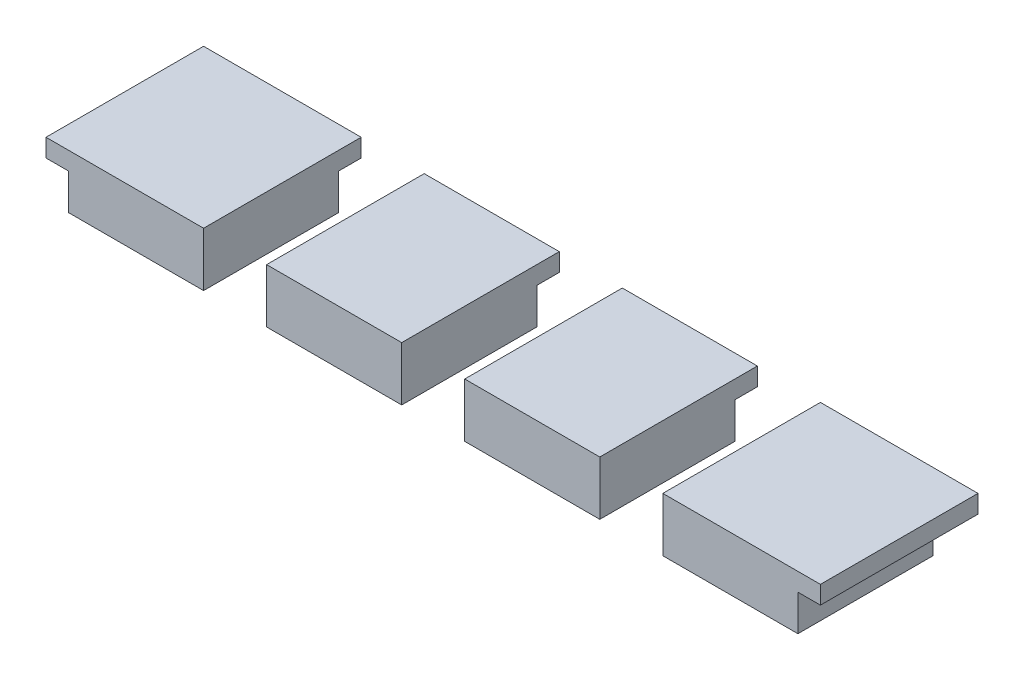
ISO-10303-21;
HEADER;
FILE_DESCRIPTION(('STEP AP214'),'2;1');
FILE_NAME('part.step','',(''),(''),'','','');
FILE_SCHEMA(('AUTOMOTIVE_DESIGN { 1 0 10303 214 1 1 1 1 }'));
ENDSEC;
DATA;
#1=APPLICATION_CONTEXT('core data for automotive mechanical design processes');
#2=APPLICATION_PROTOCOL_DEFINITION('international standard','automotive_design',2000,#1);
#3=PRODUCT_CONTEXT('',#1,'mechanical');
#4=PRODUCT('Part','Part','',(#3));
#5=PRODUCT_RELATED_PRODUCT_CATEGORY('part','',(#4));
#6=PRODUCT_DEFINITION_FORMATION('','',#4);
#7=PRODUCT_DEFINITION_CONTEXT('part definition',#1,'design');
#8=PRODUCT_DEFINITION('design','',#6,#7);
#9=PRODUCT_DEFINITION_SHAPE('','',#8);
#10=(LENGTH_UNIT() NAMED_UNIT(*) SI_UNIT(.MILLI.,.METRE.));
#11=(NAMED_UNIT(*) PLANE_ANGLE_UNIT() SI_UNIT($,.RADIAN.));
#12=(NAMED_UNIT(*) SI_UNIT($,.STERADIAN.) SOLID_ANGLE_UNIT());
#13=UNCERTAINTY_MEASURE_WITH_UNIT(LENGTH_MEASURE(1.E-05),#10,'distance_accuracy_value','');
#14=(GEOMETRIC_REPRESENTATION_CONTEXT(3) GLOBAL_UNCERTAINTY_ASSIGNED_CONTEXT((#13)) GLOBAL_UNIT_ASSIGNED_CONTEXT((#10,
#11,#12)) REPRESENTATION_CONTEXT('',''));
#15=CARTESIAN_POINT('',(0.,0.,0.));
#16=DIRECTION('',(0.,0.,1.));
#17=DIRECTION('',(1.,0.,0.));
#18=AXIS2_PLACEMENT_3D('',#15,#16,#17);
#19=CARTESIAN_POINT('',(0.,73.5,0.));
#20=DIRECTION('',(0.,1.,0.));
#21=DIRECTION('',(0.,0.,1.));
#22=AXIS2_PLACEMENT_3D('',#19,#20,#21);
#23=PLANE('',#22);
#24=DIRECTION('',(-1.,0.,0.));
#25=VECTOR('',#24,1.);
#26=CARTESIAN_POINT('',(56.65,73.5,15.45));
#27=LINE('',#26,#25);
#28=CARTESIAN_POINT('',(56.65,73.5,15.45));
#29=VERTEX_POINT('',#28);
#30=CARTESIAN_POINT('',(47.9,73.5,15.45));
#31=VERTEX_POINT('',#30);
#32=EDGE_CURVE('E165',#29,#31,#27,.T.);
#33=ORIENTED_EDGE('',*,*,#32,.T.);
#34=DIRECTION('',(0.,0.,1.));
#35=VECTOR('',#34,1.);
#36=CARTESIAN_POINT('',(47.9,73.5,0.));
#37=LINE('',#36,#35);
#38=CARTESIAN_POINT('',(47.9,73.5,24.2));
#39=VERTEX_POINT('',#38);
#40=EDGE_CURVE('E122',#31,#39,#37,.T.);
#41=ORIENTED_EDGE('',*,*,#40,.T.);
#42=DIRECTION('',(1.,0.,0.));
#43=VECTOR('',#42,1.);
#44=CARTESIAN_POINT('',(0.,73.5,24.2));
#45=LINE('',#44,#43);
#46=CARTESIAN_POINT('',(56.65,73.5,24.2));
#47=VERTEX_POINT('',#46);
#48=EDGE_CURVE('E168',#39,#47,#45,.T.);
#49=ORIENTED_EDGE('',*,*,#48,.T.);
#50=DIRECTION('',(0.,0.,1.));
#51=VECTOR('',#50,1.);
#52=CARTESIAN_POINT('',(56.65,73.5,0.));
#53=LINE('',#52,#51);
#54=EDGE_CURVE('E162',#29,#47,#53,.T.);
#55=ORIENTED_EDGE('',*,*,#54,.F.);
#56=EDGE_LOOP('',(#33,#41,#49,#55));
#57=FACE_BOUND('',#56,.T.);
#58=ADVANCED_FACE('F75',(#57),#23,.T.);
#59=CARTESIAN_POINT('',(0.,73.5,16.7));
#60=DIRECTION('',(0.,0.,-1.));
#61=DIRECTION('',(-1.,0.,0.));
#62=AXIS2_PLACEMENT_3D('',#59,#60,#61);
#63=PLANE('',#62);
#64=DIRECTION('',(0.,-1.,0.));
#65=VECTOR('',#64,1.);
#66=CARTESIAN_POINT('',(47.9,73.5,16.7));
#67=LINE('',#66,#65);
#68=CARTESIAN_POINT('',(47.9,72.5,16.7));
#69=VERTEX_POINT('',#68);
#70=CARTESIAN_POINT('',(47.9,70.5,16.7));
#71=VERTEX_POINT('',#70);
#72=EDGE_CURVE('E135',#69,#71,#67,.T.);
#73=ORIENTED_EDGE('',*,*,#72,.F.);
#74=DIRECTION('',(1.,0.,0.));
#75=VECTOR('',#74,1.);
#76=CARTESIAN_POINT('',(56.65,72.5,16.7));
#77=LINE('',#76,#75);
#78=CARTESIAN_POINT('',(55.4,72.5,16.7));
#79=VERTEX_POINT('',#78);
#80=EDGE_CURVE('E133',#69,#79,#77,.T.);
#81=ORIENTED_EDGE('',*,*,#80,.T.);
#82=DIRECTION('',(0.,1.,0.));
#83=VECTOR('',#82,1.);
#84=CARTESIAN_POINT('',(55.4,70.5,16.7));
#85=LINE('',#84,#83);
#86=CARTESIAN_POINT('',(55.4,70.5,16.7));
#87=VERTEX_POINT('',#86);
#88=EDGE_CURVE('E160',#87,#79,#85,.T.);
#89=ORIENTED_EDGE('',*,*,#88,.F.);
#90=DIRECTION('',(1.,0.,0.));
#91=VECTOR('',#90,1.);
#92=CARTESIAN_POINT('',(55.4,70.5,16.7));
#93=LINE('',#92,#91);
#94=EDGE_CURVE('E149',#71,#87,#93,.T.);
#95=ORIENTED_EDGE('',*,*,#94,.F.);
#96=EDGE_LOOP('',(#73,#81,#89,#95));
#97=FACE_BOUND('',#96,.T.);
#98=ADVANCED_FACE('F232',(#97),#63,.T.);
#99=CARTESIAN_POINT('',(0.,72.5,0.));
#100=DIRECTION('',(0.,1.,0.));
#101=DIRECTION('',(0.,0.,1.));
#102=AXIS2_PLACEMENT_3D('',#99,#100,#101);
#103=PLANE('',#102);
#104=DIRECTION('',(0.,0.,1.));
#105=VECTOR('',#104,1.);
#106=CARTESIAN_POINT('',(55.4,72.5,16.7));
#107=LINE('',#106,#105);
#108=CARTESIAN_POINT('',(55.4,72.5,24.2));
#109=VERTEX_POINT('',#108);
#110=EDGE_CURVE('E152',#79,#109,#107,.T.);
#111=ORIENTED_EDGE('',*,*,#110,.F.);
#112=ORIENTED_EDGE('',*,*,#80,.F.);
#113=DIRECTION('',(0.,0.,1.));
#114=VECTOR('',#113,1.);
#115=CARTESIAN_POINT('',(47.9,72.5,16.7));
#116=LINE('',#115,#114);
#117=CARTESIAN_POINT('',(47.9,72.5,15.45));
#118=VERTEX_POINT('',#117);
#119=EDGE_CURVE('E118',#118,#69,#116,.T.);
#120=ORIENTED_EDGE('',*,*,#119,.F.);
#121=DIRECTION('',(-1.,0.,0.));
#122=VECTOR('',#121,1.);
#123=CARTESIAN_POINT('',(56.65,72.5,15.45));
#124=LINE('',#123,#122);
#125=CARTESIAN_POINT('',(56.65,72.5,15.45));
#126=VERTEX_POINT('',#125);
#127=EDGE_CURVE('E78',#126,#118,#124,.T.);
#128=ORIENTED_EDGE('',*,*,#127,.F.);
#129=DIRECTION('',(0.,0.,1.));
#130=VECTOR('',#129,1.);
#131=CARTESIAN_POINT('',(56.65,72.5,0.));
#132=LINE('',#131,#130);
#133=CARTESIAN_POINT('',(56.65,72.5,24.2));
#134=VERTEX_POINT('',#133);
#135=EDGE_CURVE('E136',#126,#134,#132,.T.);
#136=ORIENTED_EDGE('',*,*,#135,.T.);
#137=DIRECTION('',(1.,0.,0.));
#138=VECTOR('',#137,1.);
#139=CARTESIAN_POINT('',(0.,72.5,24.2));
#140=LINE('',#139,#138);
#141=EDGE_CURVE('E163',#109,#134,#140,.T.);
#142=ORIENTED_EDGE('',*,*,#141,.F.);
#143=EDGE_LOOP('',(#111,#112,#120,#128,#136,#142));
#144=FACE_BOUND('',#143,.T.);
#145=ADVANCED_FACE('F130',(#144),#103,.F.);
#146=CARTESIAN_POINT('',(47.9,73.5,0.));
#147=DIRECTION('',(1.,0.,0.));
#148=DIRECTION('',(0.,0.,-1.));
#149=AXIS2_PLACEMENT_3D('',#146,#147,#148);
#150=PLANE('',#149);
#151=ORIENTED_EDGE('',*,*,#40,.F.);
#152=DIRECTION('',(0.,1.,0.));
#153=VECTOR('',#152,1.);
#154=CARTESIAN_POINT('',(47.9,72.5,15.45));
#155=LINE('',#154,#153);
#156=EDGE_CURVE('E13',#118,#31,#155,.T.);
#157=ORIENTED_EDGE('',*,*,#156,.F.);
#158=ORIENTED_EDGE('',*,*,#119,.T.);
#159=ORIENTED_EDGE('',*,*,#72,.T.);
#160=DIRECTION('',(0.,0.,-1.));
#161=VECTOR('',#160,1.);
#162=CARTESIAN_POINT('',(47.9,70.5,16.7));
#163=LINE('',#162,#161);
#164=CARTESIAN_POINT('',(47.9,70.5,24.2));
#165=VERTEX_POINT('',#164);
#166=EDGE_CURVE('E157',#165,#71,#163,.T.);
#167=ORIENTED_EDGE('',*,*,#166,.F.);
#168=DIRECTION('',(0.,-1.,0.));
#169=VECTOR('',#168,1.);
#170=CARTESIAN_POINT('',(47.9,73.5,24.2));
#171=LINE('',#170,#169);
#172=EDGE_CURVE('E198',#39,#165,#171,.T.);
#173=ORIENTED_EDGE('',*,*,#172,.F.);
#174=EDGE_LOOP('',(#151,#157,#158,#159,#167,#173));
#175=FACE_BOUND('',#174,.T.);
#176=ADVANCED_FACE('F117',(#175),#150,.F.);
#177=CARTESIAN_POINT('',(0.,73.5,24.2));
#178=DIRECTION('',(0.,0.,-1.));
#179=DIRECTION('',(-1.,0.,0.));
#180=AXIS2_PLACEMENT_3D('',#177,#178,#179);
#181=PLANE('',#180);
#182=ORIENTED_EDGE('',*,*,#172,.T.);
#183=DIRECTION('',(-1.,0.,0.));
#184=VECTOR('',#183,1.);
#185=CARTESIAN_POINT('',(55.4,70.5,24.2));
#186=LINE('',#185,#184);
#187=CARTESIAN_POINT('',(55.4,70.5,24.2));
#188=VERTEX_POINT('',#187);
#189=EDGE_CURVE('E142',#188,#165,#186,.T.);
#190=ORIENTED_EDGE('',*,*,#189,.F.);
#191=DIRECTION('',(0.,1.,0.));
#192=VECTOR('',#191,1.);
#193=CARTESIAN_POINT('',(55.4,70.5,24.2));
#194=LINE('',#193,#192);
#195=EDGE_CURVE('E185',#188,#109,#194,.T.);
#196=ORIENTED_EDGE('',*,*,#195,.T.);
#197=ORIENTED_EDGE('',*,*,#141,.T.);
#198=DIRECTION('',(0.,-1.,0.));
#199=VECTOR('',#198,1.);
#200=CARTESIAN_POINT('',(56.65,73.5,24.2));
#201=LINE('',#200,#199);
#202=EDGE_CURVE('E189',#47,#134,#201,.T.);
#203=ORIENTED_EDGE('',*,*,#202,.F.);
#204=ORIENTED_EDGE('',*,*,#48,.F.);
#205=EDGE_LOOP('',(#182,#190,#196,#197,#203,#204));
#206=FACE_BOUND('',#205,.T.);
#207=ADVANCED_FACE('F221',(#206),#181,.F.);
#208=CARTESIAN_POINT('',(56.65,73.5,0.));
#209=DIRECTION('',(1.,0.,0.));
#210=DIRECTION('',(0.,0.,-1.));
#211=AXIS2_PLACEMENT_3D('',#208,#209,#210);
#212=PLANE('',#211);
#213=ORIENTED_EDGE('',*,*,#135,.F.);
#214=DIRECTION('',(0.,1.,0.));
#215=VECTOR('',#214,1.);
#216=CARTESIAN_POINT('',(56.65,72.5,15.45));
#217=LINE('',#216,#215);
#218=EDGE_CURVE('E140',#126,#29,#217,.T.);
#219=ORIENTED_EDGE('',*,*,#218,.T.);
#220=ORIENTED_EDGE('',*,*,#54,.T.);
#221=ORIENTED_EDGE('',*,*,#202,.T.);
#222=EDGE_LOOP('',(#213,#219,#220,#221));
#223=FACE_BOUND('',#222,.T.);
#224=ADVANCED_FACE('F219',(#223),#212,.T.);
#225=CARTESIAN_POINT('',(55.4,70.5,16.7));
#226=DIRECTION('',(-1.,0.,0.));
#227=DIRECTION('',(0.,0.,1.));
#228=AXIS2_PLACEMENT_3D('',#225,#226,#227);
#229=PLANE('',#228);
#230=ORIENTED_EDGE('',*,*,#110,.T.);
#231=ORIENTED_EDGE('',*,*,#195,.F.);
#232=DIRECTION('',(0.,0.,1.));
#233=VECTOR('',#232,1.);
#234=CARTESIAN_POINT('',(55.4,70.5,16.7));
#235=LINE('',#234,#233);
#236=EDGE_CURVE('E93',#87,#188,#235,.T.);
#237=ORIENTED_EDGE('',*,*,#236,.F.);
#238=ORIENTED_EDGE('',*,*,#88,.T.);
#239=EDGE_LOOP('',(#230,#231,#237,#238));
#240=FACE_BOUND('',#239,.T.);
#241=ADVANCED_FACE('F212',(#240),#229,.F.);
#242=CARTESIAN_POINT('',(0.,70.5,0.));
#243=DIRECTION('',(0.,-1.,0.));
#244=DIRECTION('',(0.,0.,-1.));
#245=AXIS2_PLACEMENT_3D('',#242,#243,#244);
#246=PLANE('',#245);
#247=ORIENTED_EDGE('',*,*,#166,.T.);
#248=ORIENTED_EDGE('',*,*,#94,.T.);
#249=ORIENTED_EDGE('',*,*,#236,.T.);
#250=ORIENTED_EDGE('',*,*,#189,.T.);
#251=EDGE_LOOP('',(#247,#248,#249,#250));
#252=FACE_BOUND('',#251,.T.);
#253=ADVANCED_FACE('F243',(#252),#246,.T.);
#254=CARTESIAN_POINT('',(56.65,72.5,15.45));
#255=DIRECTION('',(0.,0.,-1.));
#256=DIRECTION('',(-1.,0.,0.));
#257=AXIS2_PLACEMENT_3D('',#254,#255,#256);
#258=PLANE('',#257);
#259=ORIENTED_EDGE('',*,*,#32,.F.);
#260=ORIENTED_EDGE('',*,*,#218,.F.);
#261=ORIENTED_EDGE('',*,*,#127,.T.);
#262=ORIENTED_EDGE('',*,*,#156,.T.);
#263=EDGE_LOOP('',(#259,#260,#261,#262));
#264=FACE_BOUND('',#263,.T.);
#265=ADVANCED_FACE('F138',(#264),#258,.T.);
#266=CLOSED_SHELL('',(#58,#98,#145,#176,#207,#224,#241,#253,#265));
#267=MANIFOLD_SOLID_BREP('B2',#266);
#268=CARTESIAN_POINT('',(14.9,70.5,16.7));
#269=DIRECTION('',(1.,0.,0.));
#270=DIRECTION('',(0.,0.,-1.));
#271=AXIS2_PLACEMENT_3D('',#268,#269,#270);
#272=PLANE('',#271);
#273=DIRECTION('',(0.,0.,-1.));
#274=VECTOR('',#273,1.);
#275=CARTESIAN_POINT('',(14.9,72.5,16.7));
#276=LINE('',#275,#274);
#277=CARTESIAN_POINT('',(14.9,72.5,24.2));
#278=VERTEX_POINT('',#277);
#279=CARTESIAN_POINT('',(14.9,72.5,16.7));
#280=VERTEX_POINT('',#279);
#281=EDGE_CURVE('E492',#278,#280,#276,.T.);
#282=ORIENTED_EDGE('',*,*,#281,.T.);
#283=DIRECTION('',(0.,1.,0.));
#284=VECTOR('',#283,1.);
#285=CARTESIAN_POINT('',(14.9,70.5,16.7));
#286=LINE('',#285,#284);
#287=CARTESIAN_POINT('',(14.9,70.5,16.7));
#288=VERTEX_POINT('',#287);
#289=EDGE_CURVE('E495',#288,#280,#286,.T.);
#290=ORIENTED_EDGE('',*,*,#289,.F.);
#291=DIRECTION('',(0.,0.,-1.));
#292=VECTOR('',#291,1.);
#293=CARTESIAN_POINT('',(14.9,70.5,16.7));
#294=LINE('',#293,#292);
#295=CARTESIAN_POINT('',(14.9,70.5,24.2));
#296=VERTEX_POINT('',#295);
#297=EDGE_CURVE('E512',#296,#288,#294,.T.);
#298=ORIENTED_EDGE('',*,*,#297,.F.);
#299=DIRECTION('',(0.,1.,0.));
#300=VECTOR('',#299,1.);
#301=CARTESIAN_POINT('',(14.9,70.5,24.2));
#302=LINE('',#301,#300);
#303=EDGE_CURVE('E497',#296,#278,#302,.T.);
#304=ORIENTED_EDGE('',*,*,#303,.T.);
#305=EDGE_LOOP('',(#282,#290,#298,#304));
#306=FACE_BOUND('',#305,.T.);
#307=ADVANCED_FACE('F421',(#306),#272,.F.);
#308=CARTESIAN_POINT('',(0.,70.5,0.));
#309=DIRECTION('',(0.,1.,0.));
#310=DIRECTION('',(0.,0.,1.));
#311=AXIS2_PLACEMENT_3D('',#308,#309,#310);
#312=PLANE('',#311);
#313=DIRECTION('',(0.,0.,1.));
#314=VECTOR('',#313,1.);
#315=CARTESIAN_POINT('',(22.4,70.5,16.7));
#316=LINE('',#315,#314);
#317=CARTESIAN_POINT('',(22.4,70.5,16.7));
#318=VERTEX_POINT('',#317);
#319=CARTESIAN_POINT('',(22.4,70.5,24.2));
#320=VERTEX_POINT('',#319);
#321=EDGE_CURVE('E541',#318,#320,#316,.T.);
#322=ORIENTED_EDGE('',*,*,#321,.T.);
#323=DIRECTION('',(-1.,0.,0.));
#324=VECTOR('',#323,1.);
#325=CARTESIAN_POINT('',(14.9,70.5,24.2));
#326=LINE('',#325,#324);
#327=EDGE_CURVE('E476',#320,#296,#326,.T.);
#328=ORIENTED_EDGE('',*,*,#327,.T.);
#329=ORIENTED_EDGE('',*,*,#297,.T.);
#330=DIRECTION('',(1.,0.,0.));
#331=VECTOR('',#330,1.);
#332=CARTESIAN_POINT('',(14.9,70.5,16.7));
#333=LINE('',#332,#331);
#334=EDGE_CURVE('E505',#288,#318,#333,.T.);
#335=ORIENTED_EDGE('',*,*,#334,.T.);
#336=EDGE_LOOP('',(#322,#328,#329,#335));
#337=FACE_BOUND('',#336,.T.);
#338=ADVANCED_FACE('F557',(#337),#312,.F.);
#339=CARTESIAN_POINT('',(0.,72.5,0.));
#340=DIRECTION('',(0.,1.,0.));
#341=DIRECTION('',(0.,0.,1.));
#342=AXIS2_PLACEMENT_3D('',#339,#340,#341);
#343=PLANE('',#342);
#344=ORIENTED_EDGE('',*,*,#281,.F.);
#345=DIRECTION('',(1.,0.,0.));
#346=VECTOR('',#345,1.);
#347=CARTESIAN_POINT('',(0.,72.5,24.2));
#348=LINE('',#347,#346);
#349=CARTESIAN_POINT('',(13.65,72.5,24.2));
#350=VERTEX_POINT('',#349);
#351=EDGE_CURVE('E460',#350,#278,#348,.T.);
#352=ORIENTED_EDGE('',*,*,#351,.F.);
#353=DIRECTION('',(0.,0.,1.));
#354=VECTOR('',#353,1.);
#355=CARTESIAN_POINT('',(13.65,72.5,0.));
#356=LINE('',#355,#354);
#357=CARTESIAN_POINT('',(13.65,72.5,15.45));
#358=VERTEX_POINT('',#357);
#359=EDGE_CURVE('E451',#358,#350,#356,.T.);
#360=ORIENTED_EDGE('',*,*,#359,.F.);
#361=DIRECTION('',(-1.,0.,0.));
#362=VECTOR('',#361,1.);
#363=CARTESIAN_POINT('',(22.4,72.5,15.45));
#364=LINE('',#363,#362);
#365=CARTESIAN_POINT('',(22.4,72.5,15.45));
#366=VERTEX_POINT('',#365);
#367=EDGE_CURVE('E517',#366,#358,#364,.T.);
#368=ORIENTED_EDGE('',*,*,#367,.F.);
#369=DIRECTION('',(0.,0.,-1.));
#370=VECTOR('',#369,1.);
#371=CARTESIAN_POINT('',(22.4,72.5,16.7));
#372=LINE('',#371,#370);
#373=CARTESIAN_POINT('',(22.4,72.5,16.7));
#374=VERTEX_POINT('',#373);
#375=EDGE_CURVE('E425',#374,#366,#372,.T.);
#376=ORIENTED_EDGE('',*,*,#375,.F.);
#377=DIRECTION('',(1.,0.,0.));
#378=VECTOR('',#377,1.);
#379=CARTESIAN_POINT('',(22.4,72.5,16.7));
#380=LINE('',#379,#378);
#381=EDGE_CURVE('E503',#280,#374,#380,.T.);
#382=ORIENTED_EDGE('',*,*,#381,.F.);
#383=EDGE_LOOP('',(#344,#352,#360,#368,#376,#382));
#384=FACE_BOUND('',#383,.T.);
#385=ADVANCED_FACE('F509',(#384),#343,.F.);
#386=CARTESIAN_POINT('',(14.9,70.5,16.7));
#387=DIRECTION('',(0.,0.,1.));
#388=DIRECTION('',(1.,0.,0.));
#389=AXIS2_PLACEMENT_3D('',#386,#387,#388);
#390=PLANE('',#389);
#391=ORIENTED_EDGE('',*,*,#381,.T.);
#392=DIRECTION('',(0.,1.,0.));
#393=VECTOR('',#392,1.);
#394=CARTESIAN_POINT('',(22.4,70.5,16.7));
#395=LINE('',#394,#393);
#396=EDGE_CURVE('E530',#318,#374,#395,.T.);
#397=ORIENTED_EDGE('',*,*,#396,.F.);
#398=ORIENTED_EDGE('',*,*,#334,.F.);
#399=ORIENTED_EDGE('',*,*,#289,.T.);
#400=EDGE_LOOP('',(#391,#397,#398,#399));
#401=FACE_BOUND('',#400,.T.);
#402=ADVANCED_FACE('F501',(#401),#390,.F.);
#403=CARTESIAN_POINT('',(14.9,70.5,24.2));
#404=DIRECTION('',(0.,0.,-1.));
#405=DIRECTION('',(-1.,0.,0.));
#406=AXIS2_PLACEMENT_3D('',#403,#404,#405);
#407=PLANE('',#406);
#408=DIRECTION('',(0.,1.,0.));
#409=VECTOR('',#408,1.);
#410=CARTESIAN_POINT('',(22.4,70.5,24.2));
#411=LINE('',#410,#409);
#412=CARTESIAN_POINT('',(22.4,73.5,24.2));
#413=VERTEX_POINT('',#412);
#414=EDGE_CURVE('E506',#320,#413,#411,.T.);
#415=ORIENTED_EDGE('',*,*,#414,.T.);
#416=DIRECTION('',(1.,0.,0.));
#417=VECTOR('',#416,1.);
#418=CARTESIAN_POINT('',(0.,73.5,24.2));
#419=LINE('',#418,#417);
#420=CARTESIAN_POINT('',(13.65,73.5,24.2));
#421=VERTEX_POINT('',#420);
#422=EDGE_CURVE('E471',#421,#413,#419,.T.);
#423=ORIENTED_EDGE('',*,*,#422,.F.);
#424=DIRECTION('',(0.,-1.,0.));
#425=VECTOR('',#424,1.);
#426=CARTESIAN_POINT('',(13.65,73.5,24.2));
#427=LINE('',#426,#425);
#428=EDGE_CURVE('E525',#421,#350,#427,.T.);
#429=ORIENTED_EDGE('',*,*,#428,.T.);
#430=ORIENTED_EDGE('',*,*,#351,.T.);
#431=ORIENTED_EDGE('',*,*,#303,.F.);
#432=ORIENTED_EDGE('',*,*,#327,.F.);
#433=EDGE_LOOP('',(#415,#423,#429,#430,#431,#432));
#434=FACE_BOUND('',#433,.T.);
#435=ADVANCED_FACE('F544',(#434),#407,.F.);
#436=CARTESIAN_POINT('',(13.65,73.5,0.));
#437=DIRECTION('',(1.,0.,0.));
#438=DIRECTION('',(0.,0.,-1.));
#439=AXIS2_PLACEMENT_3D('',#436,#437,#438);
#440=PLANE('',#439);
#441=ORIENTED_EDGE('',*,*,#359,.T.);
#442=ORIENTED_EDGE('',*,*,#428,.F.);
#443=DIRECTION('',(0.,0.,1.));
#444=VECTOR('',#443,1.);
#445=CARTESIAN_POINT('',(13.65,73.5,0.));
#446=LINE('',#445,#444);
#447=CARTESIAN_POINT('',(13.65,73.5,15.45));
#448=VERTEX_POINT('',#447);
#449=EDGE_CURVE('E531',#448,#421,#446,.T.);
#450=ORIENTED_EDGE('',*,*,#449,.F.);
#451=DIRECTION('',(0.,1.,0.));
#452=VECTOR('',#451,1.);
#453=CARTESIAN_POINT('',(13.65,72.5,15.45));
#454=LINE('',#453,#452);
#455=EDGE_CURVE('E519',#358,#448,#454,.T.);
#456=ORIENTED_EDGE('',*,*,#455,.F.);
#457=EDGE_LOOP('',(#441,#442,#450,#456));
#458=FACE_BOUND('',#457,.T.);
#459=ADVANCED_FACE('F545',(#458),#440,.F.);
#460=CARTESIAN_POINT('',(22.4,72.5,15.45));
#461=DIRECTION('',(0.,0.,-1.));
#462=DIRECTION('',(-1.,0.,0.));
#463=AXIS2_PLACEMENT_3D('',#460,#461,#462);
#464=PLANE('',#463);
#465=DIRECTION('',(-1.,0.,0.));
#466=VECTOR('',#465,1.);
#467=CARTESIAN_POINT('',(22.4,73.5,15.45));
#468=LINE('',#467,#466);
#469=CARTESIAN_POINT('',(22.4,73.5,15.45));
#470=VERTEX_POINT('',#469);
#471=EDGE_CURVE('E515',#470,#448,#468,.T.);
#472=ORIENTED_EDGE('',*,*,#471,.F.);
#473=DIRECTION('',(0.,1.,0.));
#474=VECTOR('',#473,1.);
#475=CARTESIAN_POINT('',(22.4,72.5,15.45));
#476=LINE('',#475,#474);
#477=EDGE_CURVE('E431',#366,#470,#476,.T.);
#478=ORIENTED_EDGE('',*,*,#477,.F.);
#479=ORIENTED_EDGE('',*,*,#367,.T.);
#480=ORIENTED_EDGE('',*,*,#455,.T.);
#481=EDGE_LOOP('',(#472,#478,#479,#480));
#482=FACE_BOUND('',#481,.T.);
#483=ADVANCED_FACE('F547',(#482),#464,.T.);
#484=CARTESIAN_POINT('',(0.,73.5,0.));
#485=DIRECTION('',(0.,1.,0.));
#486=DIRECTION('',(0.,0.,1.));
#487=AXIS2_PLACEMENT_3D('',#484,#485,#486);
#488=PLANE('',#487);
#489=ORIENTED_EDGE('',*,*,#422,.T.);
#490=DIRECTION('',(0.,0.,1.));
#491=VECTOR('',#490,1.);
#492=CARTESIAN_POINT('',(22.4,73.5,0.));
#493=LINE('',#492,#491);
#494=EDGE_CURVE('E73',#470,#413,#493,.T.);
#495=ORIENTED_EDGE('',*,*,#494,.F.);
#496=ORIENTED_EDGE('',*,*,#471,.T.);
#497=ORIENTED_EDGE('',*,*,#449,.T.);
#498=EDGE_LOOP('',(#489,#495,#496,#497));
#499=FACE_BOUND('',#498,.T.);
#500=ADVANCED_FACE('F423',(#499),#488,.T.);
#501=CARTESIAN_POINT('',(22.4,70.5,16.7));
#502=DIRECTION('',(-1.,0.,0.));
#503=DIRECTION('',(0.,0.,1.));
#504=AXIS2_PLACEMENT_3D('',#501,#502,#503);
#505=PLANE('',#504);
#506=ORIENTED_EDGE('',*,*,#396,.T.);
#507=ORIENTED_EDGE('',*,*,#375,.T.);
#508=ORIENTED_EDGE('',*,*,#477,.T.);
#509=ORIENTED_EDGE('',*,*,#494,.T.);
#510=ORIENTED_EDGE('',*,*,#414,.F.);
#511=ORIENTED_EDGE('',*,*,#321,.F.);
#512=EDGE_LOOP('',(#506,#507,#508,#509,#510,#511));
#513=FACE_BOUND('',#512,.T.);
#514=ADVANCED_FACE('F656',(#513),#505,.F.);
#515=CLOSED_SHELL('',(#307,#338,#385,#402,#435,#459,#483,#500,#514));
#516=MANIFOLD_SOLID_BREP('B7',#515);
#517=CARTESIAN_POINT('',(0.,70.5,0.));
#518=DIRECTION('',(0.,1.,0.));
#519=DIRECTION('',(0.,0.,1.));
#520=AXIS2_PLACEMENT_3D('',#517,#518,#519);
#521=PLANE('',#520);
#522=DIRECTION('',(0.,0.,1.));
#523=VECTOR('',#522,1.);
#524=CARTESIAN_POINT('',(33.4,70.5,16.7));
#525=LINE('',#524,#523);
#526=CARTESIAN_POINT('',(33.4,70.5,16.7));
#527=VERTEX_POINT('',#526);
#528=CARTESIAN_POINT('',(33.4,70.5,24.2));
#529=VERTEX_POINT('',#528);
#530=EDGE_CURVE('E815',#527,#529,#525,.T.);
#531=ORIENTED_EDGE('',*,*,#530,.T.);
#532=DIRECTION('',(-1.,0.,0.));
#533=VECTOR('',#532,1.);
#534=CARTESIAN_POINT('',(25.9,70.5,24.2));
#535=LINE('',#534,#533);
#536=CARTESIAN_POINT('',(25.9,70.5,24.2));
#537=VERTEX_POINT('',#536);
#538=EDGE_CURVE('E820',#529,#537,#535,.T.);
#539=ORIENTED_EDGE('',*,*,#538,.T.);
#540=DIRECTION('',(0.,0.,-1.));
#541=VECTOR('',#540,1.);
#542=CARTESIAN_POINT('',(25.9,70.5,16.7));
#543=LINE('',#542,#541);
#544=CARTESIAN_POINT('',(25.9,70.5,16.7));
#545=VERTEX_POINT('',#544);
#546=EDGE_CURVE('E817',#537,#545,#543,.T.);
#547=ORIENTED_EDGE('',*,*,#546,.T.);
#548=DIRECTION('',(1.,0.,0.));
#549=VECTOR('',#548,1.);
#550=CARTESIAN_POINT('',(25.9,70.5,16.7));
#551=LINE('',#550,#549);
#552=EDGE_CURVE('E806',#545,#527,#551,.T.);
#553=ORIENTED_EDGE('',*,*,#552,.T.);
#554=EDGE_LOOP('',(#531,#539,#547,#553));
#555=FACE_BOUND('',#554,.T.);
#556=ADVANCED_FACE('F745',(#555),#521,.F.);
#557=CARTESIAN_POINT('',(0.,73.5,16.7));
#558=DIRECTION('',(0.,0.,1.));
#559=DIRECTION('',(1.,0.,0.));
#560=AXIS2_PLACEMENT_3D('',#557,#558,#559);
#561=PLANE('',#560);
#562=DIRECTION('',(1.,0.,0.));
#563=VECTOR('',#562,1.);
#564=CARTESIAN_POINT('',(33.4,72.5,16.7));
#565=LINE('',#564,#563);
#566=CARTESIAN_POINT('',(25.9,72.5,16.7));
#567=VERTEX_POINT('',#566);
#568=CARTESIAN_POINT('',(33.4,72.5,16.7));
#569=VERTEX_POINT('',#568);
#570=EDGE_CURVE('E807',#567,#569,#565,.T.);
#571=ORIENTED_EDGE('',*,*,#570,.T.);
#572=DIRECTION('',(0.,-1.,0.));
#573=VECTOR('',#572,1.);
#574=CARTESIAN_POINT('',(33.4,73.5,16.7));
#575=LINE('',#574,#573);
#576=EDGE_CURVE('E802',#569,#527,#575,.T.);
#577=ORIENTED_EDGE('',*,*,#576,.T.);
#578=ORIENTED_EDGE('',*,*,#552,.F.);
#579=DIRECTION('',(0.,-1.,0.));
#580=VECTOR('',#579,1.);
#581=CARTESIAN_POINT('',(25.9,73.5,16.7));
#582=LINE('',#581,#580);
#583=EDGE_CURVE('E835',#567,#545,#582,.T.);
#584=ORIENTED_EDGE('',*,*,#583,.F.);
#585=EDGE_LOOP('',(#571,#577,#578,#584));
#586=FACE_BOUND('',#585,.T.);
#587=ADVANCED_FACE('F804',(#586),#561,.F.);
#588=CARTESIAN_POINT('',(0.,72.5,0.));
#589=DIRECTION('',(0.,1.,0.));
#590=DIRECTION('',(0.,0.,1.));
#591=AXIS2_PLACEMENT_3D('',#588,#589,#590);
#592=PLANE('',#591);
#593=ORIENTED_EDGE('',*,*,#570,.F.);
#594=DIRECTION('',(0.,0.,1.));
#595=VECTOR('',#594,1.);
#596=CARTESIAN_POINT('',(25.9,72.5,16.7));
#597=LINE('',#596,#595);
#598=CARTESIAN_POINT('',(25.9,72.5,15.45));
#599=VERTEX_POINT('',#598);
#600=EDGE_CURVE('E749',#599,#567,#597,.T.);
#601=ORIENTED_EDGE('',*,*,#600,.F.);
#602=DIRECTION('',(-1.,0.,0.));
#603=VECTOR('',#602,1.);
#604=CARTESIAN_POINT('',(33.4,72.5,15.45));
#605=LINE('',#604,#603);
#606=CARTESIAN_POINT('',(33.4,72.5,15.45));
#607=VERTEX_POINT('',#606);
#608=EDGE_CURVE('E831',#607,#599,#605,.T.);
#609=ORIENTED_EDGE('',*,*,#608,.F.);
#610=DIRECTION('',(0.,0.,-1.));
#611=VECTOR('',#610,1.);
#612=CARTESIAN_POINT('',(33.4,72.5,16.7));
#613=LINE('',#612,#611);
#614=EDGE_CURVE('E755',#569,#607,#613,.T.);
#615=ORIENTED_EDGE('',*,*,#614,.F.);
#616=EDGE_LOOP('',(#593,#601,#609,#615));
#617=FACE_BOUND('',#616,.T.);
#618=ADVANCED_FACE('F865',(#617),#592,.F.);
#619=CARTESIAN_POINT('',(0.,73.5,24.2));
#620=DIRECTION('',(0.,0.,-1.));
#621=DIRECTION('',(-1.,0.,0.));
#622=AXIS2_PLACEMENT_3D('',#619,#620,#621);
#623=PLANE('',#622);
#624=DIRECTION('',(0.,-1.,0.));
#625=VECTOR('',#624,1.);
#626=CARTESIAN_POINT('',(25.9,73.5,24.2));
#627=LINE('',#626,#625);
#628=CARTESIAN_POINT('',(25.9,73.5,24.2));
#629=VERTEX_POINT('',#628);
#630=EDGE_CURVE('E809',#629,#537,#627,.T.);
#631=ORIENTED_EDGE('',*,*,#630,.T.);
#632=ORIENTED_EDGE('',*,*,#538,.F.);
#633=DIRECTION('',(0.,-1.,0.));
#634=VECTOR('',#633,1.);
#635=CARTESIAN_POINT('',(33.4,73.5,24.2));
#636=LINE('',#635,#634);
#637=CARTESIAN_POINT('',(33.4,73.5,24.2));
#638=VERTEX_POINT('',#637);
#639=EDGE_CURVE('E764',#638,#529,#636,.T.);
#640=ORIENTED_EDGE('',*,*,#639,.F.);
#641=DIRECTION('',(1.,0.,0.));
#642=VECTOR('',#641,1.);
#643=CARTESIAN_POINT('',(0.,73.5,24.2));
#644=LINE('',#643,#642);
#645=EDGE_CURVE('E834',#629,#638,#644,.T.);
#646=ORIENTED_EDGE('',*,*,#645,.F.);
#647=EDGE_LOOP('',(#631,#632,#640,#646));
#648=FACE_BOUND('',#647,.T.);
#649=ADVANCED_FACE('F848',(#648),#623,.F.);
#650=CARTESIAN_POINT('',(33.4,72.5,15.45));
#651=DIRECTION('',(0.,0.,-1.));
#652=DIRECTION('',(-1.,0.,0.));
#653=AXIS2_PLACEMENT_3D('',#650,#651,#652);
#654=PLANE('',#653);
#655=DIRECTION('',(0.,-1.,0.));
#656=VECTOR('',#655,1.);
#657=CARTESIAN_POINT('',(25.9,73.5,15.45));
#658=LINE('',#657,#656);
#659=CARTESIAN_POINT('',(25.9,73.5,15.45));
#660=VERTEX_POINT('',#659);
#661=EDGE_CURVE('E791',#660,#599,#658,.T.);
#662=ORIENTED_EDGE('',*,*,#661,.F.);
#663=DIRECTION('',(-1.,0.,0.));
#664=VECTOR('',#663,1.);
#665=CARTESIAN_POINT('',(33.4,73.5,15.45));
#666=LINE('',#665,#664);
#667=CARTESIAN_POINT('',(33.4,73.5,15.45));
#668=VERTEX_POINT('',#667);
#669=EDGE_CURVE('E825',#668,#660,#666,.T.);
#670=ORIENTED_EDGE('',*,*,#669,.F.);
#671=DIRECTION('',(0.,1.,0.));
#672=VECTOR('',#671,1.);
#673=CARTESIAN_POINT('',(33.4,72.5,15.45));
#674=LINE('',#673,#672);
#675=EDGE_CURVE('E419',#607,#668,#674,.T.);
#676=ORIENTED_EDGE('',*,*,#675,.F.);
#677=ORIENTED_EDGE('',*,*,#608,.T.);
#678=EDGE_LOOP('',(#662,#670,#676,#677));
#679=FACE_BOUND('',#678,.T.);
#680=ADVANCED_FACE('F858',(#679),#654,.T.);
#681=CARTESIAN_POINT('',(0.,73.5,0.));
#682=DIRECTION('',(0.,1.,0.));
#683=DIRECTION('',(0.,0.,1.));
#684=AXIS2_PLACEMENT_3D('',#681,#682,#683);
#685=PLANE('',#684);
#686=ORIENTED_EDGE('',*,*,#645,.T.);
#687=DIRECTION('',(0.,0.,-1.));
#688=VECTOR('',#687,1.);
#689=CARTESIAN_POINT('',(33.4,73.5,0.));
#690=LINE('',#689,#688);
#691=EDGE_CURVE('E829',#638,#668,#690,.T.);
#692=ORIENTED_EDGE('',*,*,#691,.T.);
#693=ORIENTED_EDGE('',*,*,#669,.T.);
#694=DIRECTION('',(0.,0.,1.));
#695=VECTOR('',#694,1.);
#696=CARTESIAN_POINT('',(25.9,73.5,0.));
#697=LINE('',#696,#695);
#698=EDGE_CURVE('E828',#660,#629,#697,.T.);
#699=ORIENTED_EDGE('',*,*,#698,.T.);
#700=EDGE_LOOP('',(#686,#692,#693,#699));
#701=FACE_BOUND('',#700,.T.);
#702=ADVANCED_FACE('F747',(#701),#685,.T.);
#703=CARTESIAN_POINT('',(25.9,73.5,0.));
#704=DIRECTION('',(1.,0.,0.));
#705=DIRECTION('',(0.,0.,-1.));
#706=AXIS2_PLACEMENT_3D('',#703,#704,#705);
#707=PLANE('',#706);
#708=ORIENTED_EDGE('',*,*,#630,.F.);
#709=ORIENTED_EDGE('',*,*,#698,.F.);
#710=ORIENTED_EDGE('',*,*,#661,.T.);
#711=ORIENTED_EDGE('',*,*,#600,.T.);
#712=ORIENTED_EDGE('',*,*,#583,.T.);
#713=ORIENTED_EDGE('',*,*,#546,.F.);
#714=EDGE_LOOP('',(#708,#709,#710,#711,#712,#713));
#715=FACE_BOUND('',#714,.T.);
#716=ADVANCED_FACE('F849',(#715),#707,.F.);
#717=CARTESIAN_POINT('',(33.4,73.5,0.));
#718=DIRECTION('',(-1.,0.,0.));
#719=DIRECTION('',(0.,0.,1.));
#720=AXIS2_PLACEMENT_3D('',#717,#718,#719);
#721=PLANE('',#720);
#722=ORIENTED_EDGE('',*,*,#639,.T.);
#723=ORIENTED_EDGE('',*,*,#530,.F.);
#724=ORIENTED_EDGE('',*,*,#576,.F.);
#725=ORIENTED_EDGE('',*,*,#614,.T.);
#726=ORIENTED_EDGE('',*,*,#675,.T.);
#727=ORIENTED_EDGE('',*,*,#691,.F.);
#728=EDGE_LOOP('',(#722,#723,#724,#725,#726,#727));
#729=FACE_BOUND('',#728,.T.);
#730=ADVANCED_FACE('F819',(#729),#721,.F.);
#731=CLOSED_SHELL('',(#556,#587,#618,#649,#680,#702,#716,#730));
#732=MANIFOLD_SOLID_BREP('B67',#731);
#733=CARTESIAN_POINT('',(0.,70.5,0.));
#734=DIRECTION('',(0.,1.,0.));
#735=DIRECTION('',(0.,0.,1.));
#736=AXIS2_PLACEMENT_3D('',#733,#734,#735);
#737=PLANE('',#736);
#738=DIRECTION('',(0.,0.,1.));
#739=VECTOR('',#738,1.);
#740=CARTESIAN_POINT('',(44.4,70.5,16.7));
#741=LINE('',#740,#739);
#742=CARTESIAN_POINT('',(44.4,70.5,16.7));
#743=VERTEX_POINT('',#742);
#744=CARTESIAN_POINT('',(44.4,70.5,24.2));
#745=VERTEX_POINT('',#744);
#746=EDGE_CURVE('E1095',#743,#745,#741,.T.);
#747=ORIENTED_EDGE('',*,*,#746,.T.);
#748=DIRECTION('',(-1.,0.,0.));
#749=VECTOR('',#748,1.);
#750=CARTESIAN_POINT('',(36.9,70.5,24.2));
#751=LINE('',#750,#749);
#752=CARTESIAN_POINT('',(36.9,70.5,24.2));
#753=VERTEX_POINT('',#752);
#754=EDGE_CURVE('E1099',#745,#753,#751,.T.);
#755=ORIENTED_EDGE('',*,*,#754,.T.);
#756=DIRECTION('',(0.,0.,-1.));
#757=VECTOR('',#756,1.);
#758=CARTESIAN_POINT('',(36.9,70.5,16.7));
#759=LINE('',#758,#757);
#760=CARTESIAN_POINT('',(36.9,70.5,16.7));
#761=VERTEX_POINT('',#760);
#762=EDGE_CURVE('E1102',#753,#761,#759,.T.);
#763=ORIENTED_EDGE('',*,*,#762,.T.);
#764=DIRECTION('',(1.,0.,0.));
#765=VECTOR('',#764,1.);
#766=CARTESIAN_POINT('',(36.9,70.5,16.7));
#767=LINE('',#766,#765);
#768=EDGE_CURVE('E1105',#761,#743,#767,.T.);
#769=ORIENTED_EDGE('',*,*,#768,.T.);
#770=EDGE_LOOP('',(#747,#755,#763,#769));
#771=FACE_BOUND('',#770,.T.);
#772=ADVANCED_FACE('F1016',(#771),#737,.F.);
#773=CARTESIAN_POINT('',(0.,73.5,16.7));
#774=DIRECTION('',(0.,0.,-1.));
#775=DIRECTION('',(-1.,0.,0.));
#776=AXIS2_PLACEMENT_3D('',#773,#774,#775);
#777=PLANE('',#776);
#778=DIRECTION('',(0.,-1.,0.));
#779=VECTOR('',#778,1.);
#780=CARTESIAN_POINT('',(36.9,73.5,16.7));
#781=LINE('',#780,#779);
#782=CARTESIAN_POINT('',(36.9,72.5,16.7));
#783=VERTEX_POINT('',#782);
#784=EDGE_CURVE('E1031',#783,#761,#781,.T.);
#785=ORIENTED_EDGE('',*,*,#784,.F.);
#786=DIRECTION('',(1.,0.,0.));
#787=VECTOR('',#786,1.);
#788=CARTESIAN_POINT('',(44.4,72.5,16.7));
#789=LINE('',#788,#787);
#790=CARTESIAN_POINT('',(44.4,72.5,16.7));
#791=VERTEX_POINT('',#790);
#792=EDGE_CURVE('E1036',#783,#791,#789,.T.);
#793=ORIENTED_EDGE('',*,*,#792,.T.);
#794=DIRECTION('',(0.,-1.,0.));
#795=VECTOR('',#794,1.);
#796=CARTESIAN_POINT('',(44.4,73.5,16.7));
#797=LINE('',#796,#795);
#798=EDGE_CURVE('E1089',#791,#743,#797,.T.);
#799=ORIENTED_EDGE('',*,*,#798,.T.);
#800=ORIENTED_EDGE('',*,*,#768,.F.);
#801=EDGE_LOOP('',(#785,#793,#799,#800));
#802=FACE_BOUND('',#801,.T.);
#803=ADVANCED_FACE('F1123',(#802),#777,.T.);
#804=CARTESIAN_POINT('',(0.,72.5,0.));
#805=DIRECTION('',(0.,1.,0.));
#806=DIRECTION('',(0.,0.,1.));
#807=AXIS2_PLACEMENT_3D('',#804,#805,#806);
#808=PLANE('',#807);
#809=DIRECTION('',(0.,0.,-1.));
#810=VECTOR('',#809,1.);
#811=CARTESIAN_POINT('',(44.4,72.5,16.7));
#812=LINE('',#811,#810);
#813=CARTESIAN_POINT('',(44.4,72.5,15.45));
#814=VERTEX_POINT('',#813);
#815=EDGE_CURVE('E1084',#791,#814,#812,.T.);
#816=ORIENTED_EDGE('',*,*,#815,.F.);
#817=ORIENTED_EDGE('',*,*,#792,.F.);
#818=DIRECTION('',(0.,0.,1.));
#819=VECTOR('',#818,1.);
#820=CARTESIAN_POINT('',(36.9,72.5,16.7));
#821=LINE('',#820,#819);
#822=CARTESIAN_POINT('',(36.9,72.5,15.45));
#823=VERTEX_POINT('',#822);
#824=EDGE_CURVE('E1085',#823,#783,#821,.T.);
#825=ORIENTED_EDGE('',*,*,#824,.F.);
#826=DIRECTION('',(-1.,0.,0.));
#827=VECTOR('',#826,1.);
#828=CARTESIAN_POINT('',(44.4,72.5,15.45));
#829=LINE('',#828,#827);
#830=EDGE_CURVE('E1072',#814,#823,#829,.T.);
#831=ORIENTED_EDGE('',*,*,#830,.F.);
#832=EDGE_LOOP('',(#816,#817,#825,#831));
#833=FACE_BOUND('',#832,.T.);
#834=ADVANCED_FACE('F1083',(#833),#808,.F.);
#835=CARTESIAN_POINT('',(0.,73.5,24.2));
#836=DIRECTION('',(0.,0.,-1.));
#837=DIRECTION('',(-1.,0.,0.));
#838=AXIS2_PLACEMENT_3D('',#835,#836,#837);
#839=PLANE('',#838);
#840=DIRECTION('',(0.,-1.,0.));
#841=VECTOR('',#840,1.);
#842=CARTESIAN_POINT('',(36.9,73.5,24.2));
#843=LINE('',#842,#841);
#844=CARTESIAN_POINT('',(36.9,73.5,24.2));
#845=VERTEX_POINT('',#844);
#846=EDGE_CURVE('E743',#845,#753,#843,.T.);
#847=ORIENTED_EDGE('',*,*,#846,.T.);
#848=ORIENTED_EDGE('',*,*,#754,.F.);
#849=DIRECTION('',(0.,-1.,0.));
#850=VECTOR('',#849,1.);
#851=CARTESIAN_POINT('',(44.4,73.5,24.2));
#852=LINE('',#851,#850);
#853=CARTESIAN_POINT('',(44.4,73.5,24.2));
#854=VERTEX_POINT('',#853);
#855=EDGE_CURVE('E1024',#854,#745,#852,.T.);
#856=ORIENTED_EDGE('',*,*,#855,.F.);
#857=DIRECTION('',(1.,0.,0.));
#858=VECTOR('',#857,1.);
#859=CARTESIAN_POINT('',(0.,73.5,24.2));
#860=LINE('',#859,#858);
#861=EDGE_CURVE('E1110',#845,#854,#860,.T.);
#862=ORIENTED_EDGE('',*,*,#861,.F.);
#863=EDGE_LOOP('',(#847,#848,#856,#862));
#864=FACE_BOUND('',#863,.T.);
#865=ADVANCED_FACE('F1119',(#864),#839,.F.);
#866=CARTESIAN_POINT('',(44.4,72.5,15.45));
#867=DIRECTION('',(0.,0.,-1.));
#868=DIRECTION('',(-1.,0.,0.));
#869=AXIS2_PLACEMENT_3D('',#866,#867,#868);
#870=PLANE('',#869);
#871=DIRECTION('',(-1.,0.,0.));
#872=VECTOR('',#871,1.);
#873=CARTESIAN_POINT('',(44.4,73.5,15.45));
#874=LINE('',#873,#872);
#875=CARTESIAN_POINT('',(44.4,73.5,15.45));
#876=VERTEX_POINT('',#875);
#877=CARTESIAN_POINT('',(36.9,73.5,15.45));
#878=VERTEX_POINT('',#877);
#879=EDGE_CURVE('E1074',#876,#878,#874,.T.);
#880=ORIENTED_EDGE('',*,*,#879,.F.);
#881=DIRECTION('',(0.,1.,0.));
#882=VECTOR('',#881,1.);
#883=CARTESIAN_POINT('',(44.4,72.5,15.45));
#884=LINE('',#883,#882);
#885=EDGE_CURVE('E1068',#814,#876,#884,.T.);
#886=ORIENTED_EDGE('',*,*,#885,.F.);
#887=ORIENTED_EDGE('',*,*,#830,.T.);
#888=DIRECTION('',(0.,1.,0.));
#889=VECTOR('',#888,1.);
#890=CARTESIAN_POINT('',(36.9,72.5,15.45));
#891=LINE('',#890,#889);
#892=EDGE_CURVE('E1078',#823,#878,#891,.T.);
#893=ORIENTED_EDGE('',*,*,#892,.T.);
#894=EDGE_LOOP('',(#880,#886,#887,#893));
#895=FACE_BOUND('',#894,.T.);
#896=ADVANCED_FACE('F1070',(#895),#870,.T.);
#897=CARTESIAN_POINT('',(0.,73.5,0.));
#898=DIRECTION('',(0.,1.,0.));
#899=DIRECTION('',(0.,0.,1.));
#900=AXIS2_PLACEMENT_3D('',#897,#898,#899);
#901=PLANE('',#900);
#902=DIRECTION('',(0.,0.,1.));
#903=VECTOR('',#902,1.);
#904=CARTESIAN_POINT('',(44.4,73.5,0.));
#905=LINE('',#904,#903);
#906=EDGE_CURVE('E1112',#876,#854,#905,.T.);
#907=ORIENTED_EDGE('',*,*,#906,.F.);
#908=ORIENTED_EDGE('',*,*,#879,.T.);
#909=DIRECTION('',(0.,0.,1.));
#910=VECTOR('',#909,1.);
#911=CARTESIAN_POINT('',(36.9,73.5,0.));
#912=LINE('',#911,#910);
#913=EDGE_CURVE('E1108',#878,#845,#912,.T.);
#914=ORIENTED_EDGE('',*,*,#913,.T.);
#915=ORIENTED_EDGE('',*,*,#861,.T.);
#916=EDGE_LOOP('',(#907,#908,#914,#915));
#917=FACE_BOUND('',#916,.T.);
#918=ADVANCED_FACE('F1135',(#917),#901,.T.);
#919=CARTESIAN_POINT('',(36.9,73.5,0.));
#920=DIRECTION('',(1.,0.,0.));
#921=DIRECTION('',(0.,0.,-1.));
#922=AXIS2_PLACEMENT_3D('',#919,#920,#921);
#923=PLANE('',#922);
#924=ORIENTED_EDGE('',*,*,#913,.F.);
#925=ORIENTED_EDGE('',*,*,#892,.F.);
#926=ORIENTED_EDGE('',*,*,#824,.T.);
#927=ORIENTED_EDGE('',*,*,#784,.T.);
#928=ORIENTED_EDGE('',*,*,#762,.F.);
#929=ORIENTED_EDGE('',*,*,#846,.F.);
#930=EDGE_LOOP('',(#924,#925,#926,#927,#928,#929));
#931=FACE_BOUND('',#930,.T.);
#932=ADVANCED_FACE('F1018',(#931),#923,.F.);
#933=CARTESIAN_POINT('',(44.4,73.5,0.));
#934=DIRECTION('',(1.,0.,0.));
#935=DIRECTION('',(0.,0.,-1.));
#936=AXIS2_PLACEMENT_3D('',#933,#934,#935);
#937=PLANE('',#936);
#938=ORIENTED_EDGE('',*,*,#855,.T.);
#939=ORIENTED_EDGE('',*,*,#746,.F.);
#940=ORIENTED_EDGE('',*,*,#798,.F.);
#941=ORIENTED_EDGE('',*,*,#815,.T.);
#942=ORIENTED_EDGE('',*,*,#885,.T.);
#943=ORIENTED_EDGE('',*,*,#906,.T.);
#944=EDGE_LOOP('',(#938,#939,#940,#941,#942,#943));
#945=FACE_BOUND('',#944,.T.);
#946=ADVANCED_FACE('F1087',(#945),#937,.T.);
#947=CLOSED_SHELL('',(#772,#803,#834,#865,#896,#918,#932,#946));
#948=MANIFOLD_SOLID_BREP('B413',#947);
#949=ADVANCED_BREP_SHAPE_REPRESENTATION('',(#18,#267,#516,#732,#948),#14);
#950=SHAPE_DEFINITION_REPRESENTATION(#9,#949);
ENDSEC;
END-ISO-10303-21;
